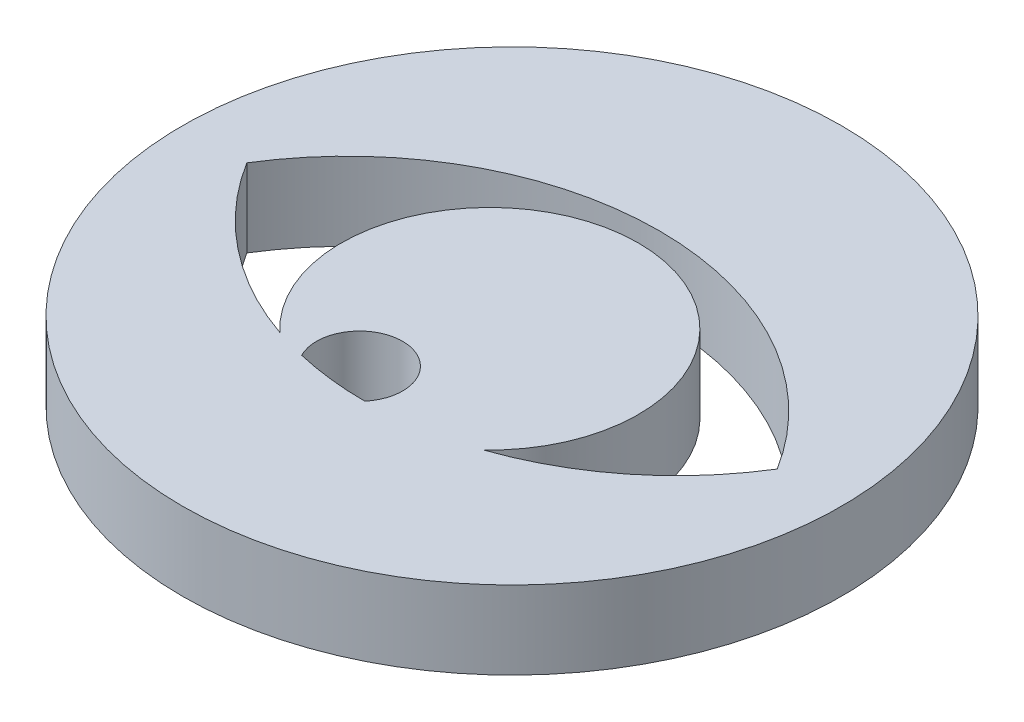
ISO-10303-21;
HEADER;
FILE_DESCRIPTION(('STEP AP214'),'2;1');
FILE_NAME('part.step','',(''),(''),'','','');
FILE_SCHEMA(('AUTOMOTIVE_DESIGN { 1 0 10303 214 1 1 1 1 }'));
ENDSEC;
DATA;
#1=APPLICATION_CONTEXT('core data for automotive mechanical design processes');
#2=APPLICATION_PROTOCOL_DEFINITION('international standard','automotive_design',2000,#1);
#3=PRODUCT_CONTEXT('',#1,'mechanical');
#4=PRODUCT('Part','Part','',(#3));
#5=PRODUCT_RELATED_PRODUCT_CATEGORY('part','',(#4));
#6=PRODUCT_DEFINITION_FORMATION('','',#4);
#7=PRODUCT_DEFINITION_CONTEXT('part definition',#1,'design');
#8=PRODUCT_DEFINITION('design','',#6,#7);
#9=PRODUCT_DEFINITION_SHAPE('','',#8);
#10=(LENGTH_UNIT() NAMED_UNIT(*) SI_UNIT(.MILLI.,.METRE.));
#11=(NAMED_UNIT(*) PLANE_ANGLE_UNIT() SI_UNIT($,.RADIAN.));
#12=(NAMED_UNIT(*) SI_UNIT($,.STERADIAN.) SOLID_ANGLE_UNIT());
#13=UNCERTAINTY_MEASURE_WITH_UNIT(LENGTH_MEASURE(1.E-05),#10,'distance_accuracy_value','');
#14=(GEOMETRIC_REPRESENTATION_CONTEXT(3) GLOBAL_UNCERTAINTY_ASSIGNED_CONTEXT((#13)) GLOBAL_UNIT_ASSIGNED_CONTEXT((#10,
#11,#12)) REPRESENTATION_CONTEXT('',''));
#15=CARTESIAN_POINT('',(0.,0.,0.));
#16=DIRECTION('',(0.,0.,1.));
#17=DIRECTION('',(1.,0.,0.));
#18=AXIS2_PLACEMENT_3D('',#15,#16,#17);
#19=CARTESIAN_POINT('',(0.,2.25,-4.75));
#20=DIRECTION('',(0.,-1.,0.));
#21=DIRECTION('',(0.,0.,-1.));
#22=AXIS2_PLACEMENT_3D('',#19,#20,#21);
#23=CYLINDRICAL_SURFACE('',#22,9.);
#24=CARTESIAN_POINT('',(0.,0.,-4.75));
#25=DIRECTION('',(0.,1.,0.));
#26=DIRECTION('',(0.,0.,1.));
#27=AXIS2_PLACEMENT_3D('',#24,#25,#26);
#28=CIRCLE('',#27,9.);
#29=CARTESIAN_POINT('',(2.93449996424574,0.,3.75815549692422));
#30=VERTEX_POINT('',#29);
#31=CARTESIAN_POINT('',(7.64444242571033,0.,0.));
#32=VERTEX_POINT('',#31);
#33=EDGE_CURVE('E128',#30,#32,#28,.T.);
#34=ORIENTED_EDGE('',*,*,#33,.F.);
#35=DIRECTION('',(0.,-1.,0.));
#36=VECTOR('',#35,1.);
#37=CARTESIAN_POINT('',(2.93449996424574,2.25,3.75815549692422));
#38=LINE('',#37,#36);
#39=CARTESIAN_POINT('',(2.93449996424574,2.25,3.75815549692422));
#40=VERTEX_POINT('',#39);
#41=EDGE_CURVE('E11',#40,#30,#38,.T.);
#42=ORIENTED_EDGE('',*,*,#41,.F.);
#43=CARTESIAN_POINT('',(0.,2.25,-4.75));
#44=DIRECTION('',(0.,1.,0.));
#45=DIRECTION('',(0.,0.,1.));
#46=AXIS2_PLACEMENT_3D('',#43,#44,#45);
#47=CIRCLE('',#46,9.);
#48=CARTESIAN_POINT('',(7.64444242571033,2.25,0.));
#49=VERTEX_POINT('',#48);
#50=EDGE_CURVE('E102',#40,#49,#47,.T.);
#51=ORIENTED_EDGE('',*,*,#50,.T.);
#52=DIRECTION('',(0.,-1.,0.));
#53=VECTOR('',#52,1.);
#54=CARTESIAN_POINT('',(7.64444242571033,2.25,0.));
#55=LINE('',#54,#53);
#56=EDGE_CURVE('E53',#49,#32,#55,.T.);
#57=ORIENTED_EDGE('',*,*,#56,.T.);
#58=EDGE_LOOP('',(#34,#42,#51,#57));
#59=FACE_BOUND('',#58,.T.);
#60=ADVANCED_FACE('F34',(#59),#23,.F.);
#61=CARTESIAN_POINT('',(0.,2.25,0.639012712812243));
#62=DIRECTION('',(0.,-1.,0.));
#63=DIRECTION('',(0.,0.,-1.));
#64=AXIS2_PLACEMENT_3D('',#61,#62,#63);
#65=CYLINDRICAL_SURFACE('',#64,4.28256252118239);
#66=CARTESIAN_POINT('',(0.,0.,0.639012712812243));
#67=DIRECTION('',(0.,1.,0.));
#68=DIRECTION('',(0.,0.,1.));
#69=AXIS2_PLACEMENT_3D('',#66,#67,#68);
#70=CIRCLE('',#69,4.28256252118239);
#71=CARTESIAN_POINT('',(-2.93449996424575,0.,3.75815549692422));
#72=VERTEX_POINT('',#71);
#73=EDGE_CURVE('E108',#30,#72,#70,.T.);
#74=ORIENTED_EDGE('',*,*,#73,.T.);
#75=DIRECTION('',(0.,-1.,0.));
#76=VECTOR('',#75,1.);
#77=CARTESIAN_POINT('',(-2.93449996424575,2.25,3.75815549692422));
#78=LINE('',#77,#76);
#79=CARTESIAN_POINT('',(-2.93449996424575,2.25,3.75815549692422));
#80=VERTEX_POINT('',#79);
#81=EDGE_CURVE('E44',#80,#72,#78,.T.);
#82=ORIENTED_EDGE('',*,*,#81,.F.);
#83=CARTESIAN_POINT('',(0.,2.25,0.639012712812243));
#84=DIRECTION('',(0.,1.,0.));
#85=DIRECTION('',(0.,0.,1.));
#86=AXIS2_PLACEMENT_3D('',#83,#84,#85);
#87=CIRCLE('',#86,4.28256252118239);
#88=EDGE_CURVE('E95',#40,#80,#87,.T.);
#89=ORIENTED_EDGE('',*,*,#88,.F.);
#90=ORIENTED_EDGE('',*,*,#41,.T.);
#91=EDGE_LOOP('',(#74,#82,#89,#90));
#92=FACE_BOUND('',#91,.T.);
#93=ADVANCED_FACE('F106',(#92),#65,.T.);
#94=CARTESIAN_POINT('',(0.,2.25,-4.75));
#95=DIRECTION('',(0.,-1.,0.));
#96=DIRECTION('',(0.,0.,-1.));
#97=AXIS2_PLACEMENT_3D('',#94,#95,#96);
#98=CYLINDRICAL_SURFACE('',#97,9.);
#99=CARTESIAN_POINT('',(0.,0.,-4.75));
#100=DIRECTION('',(0.,1.,0.));
#101=DIRECTION('',(0.,0.,1.));
#102=AXIS2_PLACEMENT_3D('',#99,#100,#101);
#103=CIRCLE('',#102,9.);
#104=CARTESIAN_POINT('',(-7.64444242571033,0.,0.));
#105=VERTEX_POINT('',#104);
#106=EDGE_CURVE('E131',#105,#72,#103,.T.);
#107=ORIENTED_EDGE('',*,*,#106,.F.);
#108=DIRECTION('',(0.,-1.,0.));
#109=VECTOR('',#108,1.);
#110=CARTESIAN_POINT('',(-7.64444242571033,2.25,0.));
#111=LINE('',#110,#109);
#112=CARTESIAN_POINT('',(-7.64444242571033,2.25,0.));
#113=VERTEX_POINT('',#112);
#114=EDGE_CURVE('E72',#113,#105,#111,.T.);
#115=ORIENTED_EDGE('',*,*,#114,.F.);
#116=CARTESIAN_POINT('',(0.,2.25,-4.75));
#117=DIRECTION('',(0.,1.,0.));
#118=DIRECTION('',(0.,0.,1.));
#119=AXIS2_PLACEMENT_3D('',#116,#117,#118);
#120=CIRCLE('',#119,9.);
#121=EDGE_CURVE('E101',#113,#80,#120,.T.);
#122=ORIENTED_EDGE('',*,*,#121,.T.);
#123=ORIENTED_EDGE('',*,*,#81,.T.);
#124=EDGE_LOOP('',(#107,#115,#122,#123));
#125=FACE_BOUND('',#124,.T.);
#126=ADVANCED_FACE('F112',(#125),#98,.F.);
#127=CARTESIAN_POINT('',(-0.943347591496523,2.25,3.45048145544321));
#128=DIRECTION('',(0.,-1.,0.));
#129=DIRECTION('',(0.,0.,-1.));
#130=AXIS2_PLACEMENT_3D('',#127,#128,#129);
#131=CYLINDRICAL_SURFACE('',#130,1.24164697611746);
#132=CARTESIAN_POINT('',(-0.943347591496523,0.,3.45048145544321));
#133=DIRECTION('',(0.,1.,0.));
#134=DIRECTION('',(0.,0.,1.));
#135=AXIS2_PLACEMENT_3D('',#132,#133,#134);
#136=CIRCLE('',#135,1.24164697611746);
#137=CARTESIAN_POINT('',(0.00663199643502292,0.,4.24999755647874));
#138=VERTEX_POINT('',#137);
#139=CARTESIAN_POINT('',(-2.05005630209394,0.,4.01340511206945));
#140=VERTEX_POINT('',#139);
#141=EDGE_CURVE('E122',#138,#140,#136,.T.);
#142=ORIENTED_EDGE('',*,*,#141,.F.);
#143=DIRECTION('',(0.,-1.,0.));
#144=VECTOR('',#143,1.);
#145=CARTESIAN_POINT('',(0.00663199643502292,2.25,4.24999755647874));
#146=LINE('',#145,#144);
#147=CARTESIAN_POINT('',(0.00663199643502292,2.25,4.24999755647874));
#148=VERTEX_POINT('',#147);
#149=EDGE_CURVE('E38',#148,#138,#146,.T.);
#150=ORIENTED_EDGE('',*,*,#149,.F.);
#151=CARTESIAN_POINT('',(-0.943347591496523,2.25,3.45048145544321));
#152=DIRECTION('',(0.,1.,0.));
#153=DIRECTION('',(0.,0.,1.));
#154=AXIS2_PLACEMENT_3D('',#151,#152,#153);
#155=CIRCLE('',#154,1.24164697611746);
#156=CARTESIAN_POINT('',(-2.05005630209394,2.25,4.01340511206945));
#157=VERTEX_POINT('',#156);
#158=EDGE_CURVE('E139',#148,#157,#155,.T.);
#159=ORIENTED_EDGE('',*,*,#158,.T.);
#160=DIRECTION('',(0.,-1.,0.));
#161=VECTOR('',#160,1.);
#162=CARTESIAN_POINT('',(-2.05005630209394,2.25,4.01340511206945));
#163=LINE('',#162,#161);
#164=EDGE_CURVE('E121',#157,#140,#163,.T.);
#165=ORIENTED_EDGE('',*,*,#164,.T.);
#166=EDGE_LOOP('',(#142,#150,#159,#165));
#167=FACE_BOUND('',#166,.T.);
#168=ADVANCED_FACE('F36',(#167),#131,.F.);
#169=CARTESIAN_POINT('',(0.,2.25,4.75));
#170=DIRECTION('',(0.,-1.,0.));
#171=DIRECTION('',(0.,0.,-1.));
#172=AXIS2_PLACEMENT_3D('',#169,#170,#171);
#173=CYLINDRICAL_SURFACE('',#172,9.);
#174=CARTESIAN_POINT('',(0.,0.,4.75));
#175=DIRECTION('',(0.,1.,0.));
#176=DIRECTION('',(0.,0.,1.));
#177=AXIS2_PLACEMENT_3D('',#174,#175,#176);
#178=CIRCLE('',#177,9.);
#179=EDGE_CURVE('E133',#32,#105,#178,.T.);
#180=ORIENTED_EDGE('',*,*,#179,.F.);
#181=ORIENTED_EDGE('',*,*,#56,.F.);
#182=CARTESIAN_POINT('',(0.,2.25,4.75));
#183=DIRECTION('',(0.,1.,0.));
#184=DIRECTION('',(0.,0.,1.));
#185=AXIS2_PLACEMENT_3D('',#182,#183,#184);
#186=CIRCLE('',#185,9.);
#187=EDGE_CURVE('E113',#49,#113,#186,.T.);
#188=ORIENTED_EDGE('',*,*,#187,.T.);
#189=ORIENTED_EDGE('',*,*,#114,.T.);
#190=EDGE_LOOP('',(#180,#181,#188,#189));
#191=FACE_BOUND('',#190,.T.);
#192=ADVANCED_FACE('F165',(#191),#173,.F.);
#193=CARTESIAN_POINT('',(0.,2.25,-4.75));
#194=DIRECTION('',(0.,-1.,0.));
#195=DIRECTION('',(0.,0.,-1.));
#196=AXIS2_PLACEMENT_3D('',#193,#194,#195);
#197=CYLINDRICAL_SURFACE('',#196,9.);
#198=CARTESIAN_POINT('',(0.,0.,-4.75));
#199=DIRECTION('',(0.,1.,0.));
#200=DIRECTION('',(0.,0.,1.));
#201=AXIS2_PLACEMENT_3D('',#198,#199,#200);
#202=CIRCLE('',#201,9.);
#203=EDGE_CURVE('E125',#140,#138,#202,.T.);
#204=ORIENTED_EDGE('',*,*,#203,.F.);
#205=ORIENTED_EDGE('',*,*,#164,.F.);
#206=CARTESIAN_POINT('',(0.,2.25,-4.75));
#207=DIRECTION('',(0.,1.,0.));
#208=DIRECTION('',(0.,0.,1.));
#209=AXIS2_PLACEMENT_3D('',#206,#207,#208);
#210=CIRCLE('',#209,9.);
#211=EDGE_CURVE('E146',#157,#148,#210,.T.);
#212=ORIENTED_EDGE('',*,*,#211,.T.);
#213=ORIENTED_EDGE('',*,*,#149,.T.);
#214=EDGE_LOOP('',(#204,#205,#212,#213));
#215=FACE_BOUND('',#214,.T.);
#216=ADVANCED_FACE('F144',(#215),#197,.F.);
#217=CARTESIAN_POINT('',(0.,2.25,0.));
#218=DIRECTION('',(0.,-1.,0.));
#219=DIRECTION('',(0.,0.,-1.));
#220=AXIS2_PLACEMENT_3D('',#217,#218,#219);
#221=CYLINDRICAL_SURFACE('',#220,9.5);
#222=CARTESIAN_POINT('',(0.,2.25,0.));
#223=DIRECTION('',(0.,1.,0.));
#224=DIRECTION('',(0.,0.,1.));
#225=AXIS2_PLACEMENT_3D('',#222,#223,#224);
#226=CIRCLE('',#225,9.5);
#227=CARTESIAN_POINT('',(0.,2.25,9.5));
#228=VERTEX_POINT('',#227);
#229=EDGE_CURVE('E115',#228,#228,#226,.T.);
#230=ORIENTED_EDGE('',*,*,#229,.F.);
#231=EDGE_LOOP('',(#230));
#232=FACE_BOUND('',#231,.T.);
#233=CARTESIAN_POINT('',(0.,0.,0.));
#234=DIRECTION('',(0.,1.,0.));
#235=DIRECTION('',(0.,0.,1.));
#236=AXIS2_PLACEMENT_3D('',#233,#234,#235);
#237=CIRCLE('',#236,9.5);
#238=CARTESIAN_POINT('',(0.,0.,9.5));
#239=VERTEX_POINT('',#238);
#240=EDGE_CURVE('E136',#239,#239,#237,.T.);
#241=ORIENTED_EDGE('',*,*,#240,.T.);
#242=EDGE_LOOP('',(#241));
#243=FACE_BOUND('',#242,.T.);
#244=ADVANCED_FACE('F155',(#232,#243),#221,.T.);
#245=CARTESIAN_POINT('',(0.,2.25,0.));
#246=DIRECTION('',(0.,1.,0.));
#247=DIRECTION('',(0.,0.,1.));
#248=AXIS2_PLACEMENT_3D('',#245,#246,#247);
#249=PLANE('',#248);
#250=ORIENTED_EDGE('',*,*,#158,.F.);
#251=ORIENTED_EDGE('',*,*,#211,.F.);
#252=EDGE_LOOP('',(#250,#251));
#253=FACE_BOUND('',#252,.T.);
#254=ORIENTED_EDGE('',*,*,#50,.F.);
#255=ORIENTED_EDGE('',*,*,#88,.T.);
#256=ORIENTED_EDGE('',*,*,#121,.F.);
#257=ORIENTED_EDGE('',*,*,#187,.F.);
#258=EDGE_LOOP('',(#254,#255,#256,#257));
#259=FACE_BOUND('',#258,.T.);
#260=ORIENTED_EDGE('',*,*,#229,.T.);
#261=EDGE_LOOP('',(#260));
#262=FACE_BOUND('',#261,.T.);
#263=ADVANCED_FACE('F97',(#253,#259,#262),#249,.T.);
#264=CARTESIAN_POINT('',(0.,0.,0.));
#265=DIRECTION('',(0.,1.,0.));
#266=DIRECTION('',(0.,0.,1.));
#267=AXIS2_PLACEMENT_3D('',#264,#265,#266);
#268=PLANE('',#267);
#269=ORIENTED_EDGE('',*,*,#141,.T.);
#270=ORIENTED_EDGE('',*,*,#203,.T.);
#271=EDGE_LOOP('',(#269,#270));
#272=FACE_BOUND('',#271,.T.);
#273=ORIENTED_EDGE('',*,*,#33,.T.);
#274=ORIENTED_EDGE('',*,*,#179,.T.);
#275=ORIENTED_EDGE('',*,*,#106,.T.);
#276=ORIENTED_EDGE('',*,*,#73,.F.);
#277=EDGE_LOOP('',(#273,#274,#275,#276));
#278=FACE_BOUND('',#277,.T.);
#279=ORIENTED_EDGE('',*,*,#240,.F.);
#280=EDGE_LOOP('',(#279));
#281=FACE_BOUND('',#280,.T.);
#282=ADVANCED_FACE('F148',(#272,#278,#281),#268,.F.);
#283=CLOSED_SHELL('',(#60,#93,#126,#168,#192,#216,#244,#263,#282));
#284=MANIFOLD_SOLID_BREP('B2',#283);
#285=ADVANCED_BREP_SHAPE_REPRESENTATION('',(#18,#284),#14);
#286=SHAPE_DEFINITION_REPRESENTATION(#9,#285);
ENDSEC;
END-ISO-10303-21;
